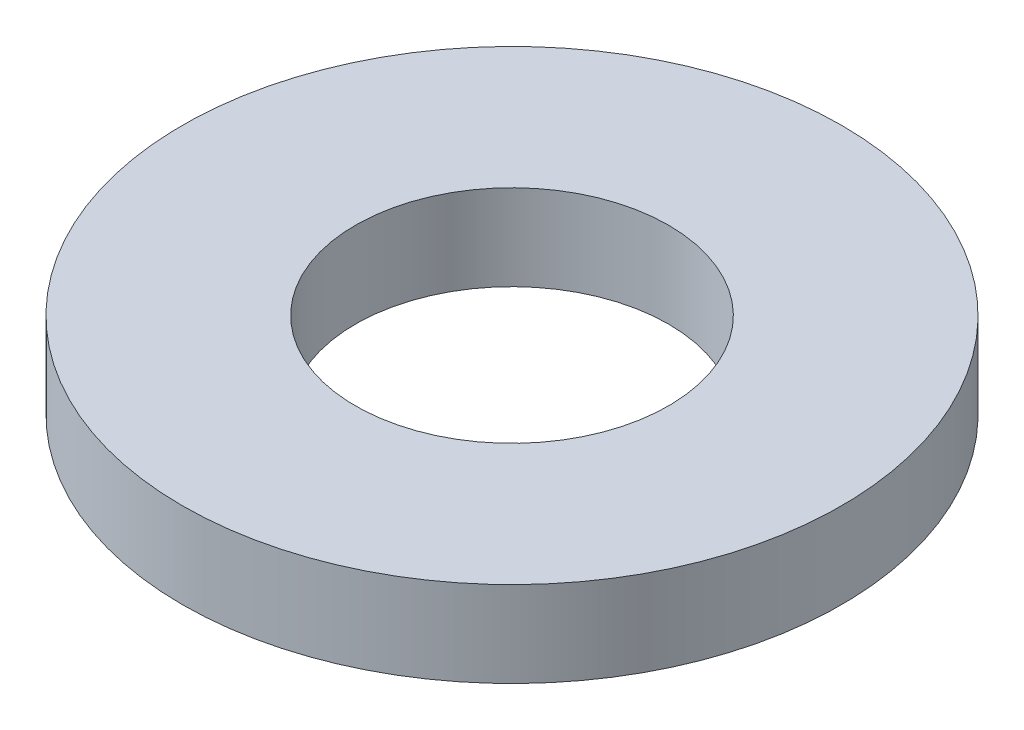
ISO-10303-21;
HEADER;
FILE_DESCRIPTION(('STEP AP214'),'2;1');
FILE_NAME('part.step','',(''),(''),'','','');
FILE_SCHEMA(('AUTOMOTIVE_DESIGN { 1 0 10303 214 1 1 1 1 }'));
ENDSEC;
DATA;
#1=APPLICATION_CONTEXT('core data for automotive mechanical design processes');
#2=APPLICATION_PROTOCOL_DEFINITION('international standard','automotive_design',2000,#1);
#3=PRODUCT_CONTEXT('',#1,'mechanical');
#4=PRODUCT('Part','Part','',(#3));
#5=PRODUCT_RELATED_PRODUCT_CATEGORY('part','',(#4));
#6=PRODUCT_DEFINITION_FORMATION('','',#4);
#7=PRODUCT_DEFINITION_CONTEXT('part definition',#1,'design');
#8=PRODUCT_DEFINITION('design','',#6,#7);
#9=PRODUCT_DEFINITION_SHAPE('','',#8);
#10=(LENGTH_UNIT() NAMED_UNIT(*) SI_UNIT(.MILLI.,.METRE.));
#11=(NAMED_UNIT(*) PLANE_ANGLE_UNIT() SI_UNIT($,.RADIAN.));
#12=(NAMED_UNIT(*) SI_UNIT($,.STERADIAN.) SOLID_ANGLE_UNIT());
#13=UNCERTAINTY_MEASURE_WITH_UNIT(LENGTH_MEASURE(1.E-05),#10,'distance_accuracy_value','');
#14=(GEOMETRIC_REPRESENTATION_CONTEXT(3) GLOBAL_UNCERTAINTY_ASSIGNED_CONTEXT((#13)) GLOBAL_UNIT_ASSIGNED_CONTEXT((#10,
#11,#12)) REPRESENTATION_CONTEXT('',''));
#15=CARTESIAN_POINT('',(0.,0.,0.));
#16=DIRECTION('',(0.,0.,1.));
#17=DIRECTION('',(1.,0.,0.));
#18=AXIS2_PLACEMENT_3D('',#15,#16,#17);
#19=CARTESIAN_POINT('',(0.,26.,0.));
#20=DIRECTION('',(0.,-1.,0.));
#21=DIRECTION('',(0.,0.,-1.));
#22=AXIS2_PLACEMENT_3D('',#19,#20,#21);
#23=CYLINDRICAL_SURFACE('',#22,100.);
#24=CARTESIAN_POINT('',(0.,26.,0.));
#25=DIRECTION('',(0.,1.,0.));
#26=DIRECTION('',(0.,0.,1.));
#27=AXIS2_PLACEMENT_3D('',#24,#25,#26);
#28=CIRCLE('',#27,100.);
#29=CARTESIAN_POINT('',(0.,26.,-100.));
#30=VERTEX_POINT('',#29);
#31=EDGE_CURVE('E10',#30,#30,#28,.T.);
#32=CARTESIAN_POINT('',(0.,0.,0.));
#33=DIRECTION('',(0.,1.,0.));
#34=DIRECTION('',(0.,0.,1.));
#35=AXIS2_PLACEMENT_3D('',#32,#33,#34);
#36=CIRCLE('',#35,100.);
#37=CARTESIAN_POINT('',(0.,0.,-100.));
#38=VERTEX_POINT('',#37);
#39=EDGE_CURVE('E37',#38,#38,#36,.T.);
#40=CARTESIAN_POINT('',(0.,26.,-100.));
#41=CARTESIAN_POINT('',(0.,25.7291666666667,-100.));
#42=CARTESIAN_POINT('',(0.,25.4583333333333,-100.));
#43=CARTESIAN_POINT('',(0.,24.9166666666667,-100.));
#44=CARTESIAN_POINT('',(0.,24.6458333333333,-100.));
#45=CARTESIAN_POINT('',(0.,24.1041666666667,-100.));
#46=CARTESIAN_POINT('',(0.,23.8333333333333,-100.));
#47=CARTESIAN_POINT('',(0.,23.2916666666667,-100.));
#48=CARTESIAN_POINT('',(0.,23.0208333333333,-100.));
#49=CARTESIAN_POINT('',(0.,22.4791666666667,-100.));
#50=CARTESIAN_POINT('',(0.,22.2083333333333,-100.));
#51=CARTESIAN_POINT('',(0.,21.6666666666667,-100.));
#52=CARTESIAN_POINT('',(0.,21.3958333333333,-100.));
#53=CARTESIAN_POINT('',(0.,20.8541666666667,-100.));
#54=CARTESIAN_POINT('',(0.,20.5833333333333,-100.));
#55=CARTESIAN_POINT('',(0.,20.0416666666667,-100.));
#56=CARTESIAN_POINT('',(0.,19.7708333333333,-100.));
#57=CARTESIAN_POINT('',(0.,19.2291666666667,-100.));
#58=CARTESIAN_POINT('',(0.,18.9583333333333,-100.));
#59=CARTESIAN_POINT('',(0.,18.4166666666667,-100.));
#60=CARTESIAN_POINT('',(0.,18.1458333333333,-100.));
#61=CARTESIAN_POINT('',(0.,17.6041666666667,-100.));
#62=CARTESIAN_POINT('',(0.,17.3333333333333,-100.));
#63=CARTESIAN_POINT('',(0.,16.7916666666667,-100.));
#64=CARTESIAN_POINT('',(0.,16.5208333333333,-100.));
#65=CARTESIAN_POINT('',(0.,15.9791666666667,-100.));
#66=CARTESIAN_POINT('',(0.,15.7083333333333,-100.));
#67=CARTESIAN_POINT('',(0.,15.1666666666667,-100.));
#68=CARTESIAN_POINT('',(0.,14.8958333333333,-100.));
#69=CARTESIAN_POINT('',(0.,14.3541666666667,-100.));
#70=CARTESIAN_POINT('',(0.,14.0833333333333,-100.));
#71=CARTESIAN_POINT('',(0.,13.5416666666667,-100.));
#72=CARTESIAN_POINT('',(0.,13.2708333333333,-100.));
#73=CARTESIAN_POINT('',(0.,12.7291666666667,-100.));
#74=CARTESIAN_POINT('',(0.,12.4583333333333,-100.));
#75=CARTESIAN_POINT('',(0.,11.9166666666667,-100.));
#76=CARTESIAN_POINT('',(0.,11.6458333333333,-100.));
#77=CARTESIAN_POINT('',(0.,11.1041666666667,-100.));
#78=CARTESIAN_POINT('',(0.,10.8333333333333,-100.));
#79=CARTESIAN_POINT('',(0.,10.2916666666667,-100.));
#80=CARTESIAN_POINT('',(0.,10.0208333333333,-100.));
#81=CARTESIAN_POINT('',(0.,9.47916666666667,-100.));
#82=CARTESIAN_POINT('',(0.,9.20833333333333,-100.));
#83=CARTESIAN_POINT('',(0.,8.66666666666667,-100.));
#84=CARTESIAN_POINT('',(0.,8.39583333333333,-100.));
#85=CARTESIAN_POINT('',(0.,7.85416666666667,-100.));
#86=CARTESIAN_POINT('',(0.,7.58333333333333,-100.));
#87=CARTESIAN_POINT('',(0.,7.04166666666667,-100.));
#88=CARTESIAN_POINT('',(0.,6.77083333333333,-100.));
#89=CARTESIAN_POINT('',(0.,6.22916666666667,-100.));
#90=CARTESIAN_POINT('',(0.,5.95833333333333,-100.));
#91=CARTESIAN_POINT('',(0.,5.41666666666667,-100.));
#92=CARTESIAN_POINT('',(0.,5.14583333333333,-100.));
#93=CARTESIAN_POINT('',(0.,4.60416666666667,-100.));
#94=CARTESIAN_POINT('',(0.,4.33333333333333,-100.));
#95=CARTESIAN_POINT('',(0.,3.79166666666667,-100.));
#96=CARTESIAN_POINT('',(0.,3.52083333333333,-100.));
#97=CARTESIAN_POINT('',(0.,2.97916666666667,-100.));
#98=CARTESIAN_POINT('',(0.,2.70833333333333,-100.));
#99=CARTESIAN_POINT('',(0.,2.16666666666667,-100.));
#100=CARTESIAN_POINT('',(0.,1.89583333333333,-100.));
#101=CARTESIAN_POINT('',(0.,1.35416666666667,-100.));
#102=CARTESIAN_POINT('',(0.,1.08333333333333,-100.));
#103=CARTESIAN_POINT('',(0.,0.541666666666667,-100.));
#104=CARTESIAN_POINT('',(0.,0.270833333333334,-100.));
#105=CARTESIAN_POINT('',(0.,0.,-100.));
#106=B_SPLINE_CURVE_WITH_KNOTS('',3,(#40,#41,#42,#43,#44,#45,#46,#47,#48,#49,#50,#51,#52,#53,
#54,#55,#56,#57,#58,#59,#60,#61,#62,#63,#64,#65,#66,#67,#68,#69,#70,#71,#72,#73,#74,#75,#76,#77,
#78,#79,#80,#81,#82,#83,#84,#85,#86,#87,#88,#89,#90,#91,#92,#93,#94,#95,#96,#97,#98,#99,#100,
#101,#102,#103,#104,#105),.UNSPECIFIED.,.F.,.F.,(4,2,2,2,2,2,2,2,2,2,2,2,2,2,2,2,2,2,2,2,2,2,2,
2,2,2,2,2,2,2,2,2,4),(0.,0.812500000000001,1.625,2.4375,3.25,4.0625,4.875,5.6875,6.5,7.3125,
8.125,8.9375,9.75,10.5625,11.375,12.1875,13.,13.8125,14.625,15.4375,16.25,17.0625,17.875,
18.6875,19.5,20.3125,21.125,21.9375,22.75,23.5625,24.375,25.1875,26.),.UNSPECIFIED.);
#107=EDGE_CURVE('BSEAM40',#30,#38,#106,.T.);
#108=ORIENTED_EDGE('',*,*,#31,.F.);
#109=ORIENTED_EDGE('',*,*,#39,.T.);
#110=ORIENTED_EDGE('',*,*,#107,.T.);
#111=ORIENTED_EDGE('',*,*,#107,.F.);
#112=EDGE_LOOP('',(#108,#110,#109,#111));
#113=FACE_BOUND('',#112,.T.);
#114=ADVANCED_FACE('F40',(#113),#23,.T.);
#115=CARTESIAN_POINT('',(0.,26.,0.));
#116=DIRECTION('',(0.,1.,0.));
#117=DIRECTION('',(0.,0.,1.));
#118=AXIS2_PLACEMENT_3D('',#115,#116,#117);
#119=PLANE('',#118);
#120=CARTESIAN_POINT('',(0.,26.,0.));
#121=DIRECTION('',(0.,1.,0.));
#122=DIRECTION('',(0.,0.,1.));
#123=AXIS2_PLACEMENT_3D('',#120,#121,#122);
#124=CIRCLE('',#123,47.5);
#125=CARTESIAN_POINT('',(0.,26.,-47.5));
#126=VERTEX_POINT('',#125);
#127=EDGE_CURVE('E50',#126,#126,#124,.T.);
#128=ORIENTED_EDGE('',*,*,#127,.F.);
#129=EDGE_LOOP('',(#128));
#130=FACE_BOUND('',#129,.T.);
#131=ORIENTED_EDGE('',*,*,#31,.T.);
#132=EDGE_LOOP('',(#131));
#133=FACE_BOUND('',#132,.T.);
#134=ADVANCED_FACE('F59',(#130,#133),#119,.T.);
#135=CARTESIAN_POINT('',(0.,0.,0.));
#136=DIRECTION('',(0.,1.,0.));
#137=DIRECTION('',(0.,0.,1.));
#138=AXIS2_PLACEMENT_3D('',#135,#136,#137);
#139=PLANE('',#138);
#140=CARTESIAN_POINT('',(0.,0.,0.));
#141=DIRECTION('',(0.,1.,0.));
#142=DIRECTION('',(0.,0.,1.));
#143=AXIS2_PLACEMENT_3D('',#140,#141,#142);
#144=CIRCLE('',#143,47.5);
#145=CARTESIAN_POINT('',(0.,0.,-47.5));
#146=VERTEX_POINT('',#145);
#147=EDGE_CURVE('E47',#146,#146,#144,.T.);
#148=ORIENTED_EDGE('',*,*,#147,.T.);
#149=EDGE_LOOP('',(#148));
#150=FACE_BOUND('',#149,.T.);
#151=ORIENTED_EDGE('',*,*,#39,.F.);
#152=EDGE_LOOP('',(#151));
#153=FACE_BOUND('',#152,.T.);
#154=ADVANCED_FACE('F58',(#150,#153),#139,.F.);
#155=CARTESIAN_POINT('',(0.,26.,0.));
#156=DIRECTION('',(0.,-1.,0.));
#157=DIRECTION('',(0.,0.,-1.));
#158=AXIS2_PLACEMENT_3D('',#155,#156,#157);
#159=CYLINDRICAL_SURFACE('',#158,47.5);
#160=CARTESIAN_POINT('',(0.,26.,-47.5));
#161=CARTESIAN_POINT('',(0.,25.7291666666667,-47.5));
#162=CARTESIAN_POINT('',(0.,25.4583333333333,-47.5));
#163=CARTESIAN_POINT('',(0.,24.9166666666667,-47.5));
#164=CARTESIAN_POINT('',(0.,24.6458333333333,-47.5));
#165=CARTESIAN_POINT('',(0.,24.1041666666667,-47.5));
#166=CARTESIAN_POINT('',(0.,23.8333333333333,-47.5));
#167=CARTESIAN_POINT('',(0.,23.2916666666667,-47.5));
#168=CARTESIAN_POINT('',(0.,23.0208333333333,-47.5));
#169=CARTESIAN_POINT('',(0.,22.4791666666667,-47.5));
#170=CARTESIAN_POINT('',(0.,22.2083333333333,-47.5));
#171=CARTESIAN_POINT('',(0.,21.6666666666667,-47.5));
#172=CARTESIAN_POINT('',(0.,21.3958333333333,-47.5));
#173=CARTESIAN_POINT('',(0.,20.8541666666667,-47.5));
#174=CARTESIAN_POINT('',(0.,20.5833333333333,-47.5));
#175=CARTESIAN_POINT('',(0.,20.0416666666667,-47.5));
#176=CARTESIAN_POINT('',(0.,19.7708333333333,-47.5));
#177=CARTESIAN_POINT('',(0.,19.2291666666667,-47.5));
#178=CARTESIAN_POINT('',(0.,18.9583333333333,-47.5));
#179=CARTESIAN_POINT('',(0.,18.4166666666667,-47.5));
#180=CARTESIAN_POINT('',(0.,18.1458333333333,-47.5));
#181=CARTESIAN_POINT('',(0.,17.6041666666667,-47.5));
#182=CARTESIAN_POINT('',(0.,17.3333333333333,-47.5));
#183=CARTESIAN_POINT('',(0.,16.7916666666667,-47.5));
#184=CARTESIAN_POINT('',(0.,16.5208333333333,-47.5));
#185=CARTESIAN_POINT('',(0.,15.9791666666667,-47.5));
#186=CARTESIAN_POINT('',(0.,15.7083333333333,-47.5));
#187=CARTESIAN_POINT('',(0.,15.1666666666667,-47.5));
#188=CARTESIAN_POINT('',(0.,14.8958333333333,-47.5));
#189=CARTESIAN_POINT('',(0.,14.3541666666667,-47.5));
#190=CARTESIAN_POINT('',(0.,14.0833333333333,-47.5));
#191=CARTESIAN_POINT('',(0.,13.5416666666667,-47.5));
#192=CARTESIAN_POINT('',(0.,13.2708333333333,-47.5));
#193=CARTESIAN_POINT('',(0.,12.7291666666667,-47.5));
#194=CARTESIAN_POINT('',(0.,12.4583333333333,-47.5));
#195=CARTESIAN_POINT('',(0.,11.9166666666667,-47.5));
#196=CARTESIAN_POINT('',(0.,11.6458333333333,-47.5));
#197=CARTESIAN_POINT('',(0.,11.1041666666667,-47.5));
#198=CARTESIAN_POINT('',(0.,10.8333333333333,-47.5));
#199=CARTESIAN_POINT('',(0.,10.2916666666667,-47.5));
#200=CARTESIAN_POINT('',(0.,10.0208333333333,-47.5));
#201=CARTESIAN_POINT('',(0.,9.47916666666667,-47.5));
#202=CARTESIAN_POINT('',(0.,9.20833333333333,-47.5));
#203=CARTESIAN_POINT('',(0.,8.66666666666667,-47.5));
#204=CARTESIAN_POINT('',(0.,8.39583333333333,-47.5));
#205=CARTESIAN_POINT('',(0.,7.85416666666667,-47.5));
#206=CARTESIAN_POINT('',(0.,7.58333333333333,-47.5));
#207=CARTESIAN_POINT('',(0.,7.04166666666667,-47.5));
#208=CARTESIAN_POINT('',(0.,6.77083333333333,-47.5));
#209=CARTESIAN_POINT('',(0.,6.22916666666667,-47.5));
#210=CARTESIAN_POINT('',(0.,5.95833333333333,-47.5));
#211=CARTESIAN_POINT('',(0.,5.41666666666667,-47.5));
#212=CARTESIAN_POINT('',(0.,5.14583333333333,-47.5));
#213=CARTESIAN_POINT('',(0.,4.60416666666667,-47.5));
#214=CARTESIAN_POINT('',(0.,4.33333333333333,-47.5));
#215=CARTESIAN_POINT('',(0.,3.79166666666667,-47.5));
#216=CARTESIAN_POINT('',(0.,3.52083333333333,-47.5));
#217=CARTESIAN_POINT('',(0.,2.97916666666667,-47.5));
#218=CARTESIAN_POINT('',(0.,2.70833333333333,-47.5));
#219=CARTESIAN_POINT('',(0.,2.16666666666667,-47.5));
#220=CARTESIAN_POINT('',(0.,1.89583333333333,-47.5));
#221=CARTESIAN_POINT('',(0.,1.35416666666667,-47.5));
#222=CARTESIAN_POINT('',(0.,1.08333333333333,-47.5));
#223=CARTESIAN_POINT('',(0.,0.541666666666667,-47.5));
#224=CARTESIAN_POINT('',(0.,0.270833333333334,-47.5));
#225=CARTESIAN_POINT('',(0.,0.,-47.5));
#226=B_SPLINE_CURVE_WITH_KNOTS('',3,(#160,#161,#162,#163,#164,#165,#166,#167,#168,#169,#170,
#171,#172,#173,#174,#175,#176,#177,#178,#179,#180,#181,#182,#183,#184,#185,#186,#187,#188,#189,
#190,#191,#192,#193,#194,#195,#196,#197,#198,#199,#200,#201,#202,#203,#204,#205,#206,#207,#208,
#209,#210,#211,#212,#213,#214,#215,#216,#217,#218,#219,#220,#221,#222,#223,#224,#225),
.UNSPECIFIED.,.F.,.F.,(4,2,2,2,2,2,2,2,2,2,2,2,2,2,2,2,2,2,2,2,2,2,2,2,2,2,2,2,2,2,2,2,4),(0.,
0.812500000000001,1.625,2.4375,3.25,4.0625,4.875,5.6875,6.5,7.3125,8.125,8.9375,9.75,10.5625,
11.375,12.1875,13.,13.8125,14.625,15.4375,16.25,17.0625,17.875,18.6875,19.5,20.3125,21.125,
21.9375,22.75,23.5625,24.375,25.1875,26.),.UNSPECIFIED.);
#227=EDGE_CURVE('BSEAM54',#126,#146,#226,.T.);
#228=ORIENTED_EDGE('',*,*,#127,.T.);
#229=ORIENTED_EDGE('',*,*,#147,.F.);
#230=ORIENTED_EDGE('',*,*,#227,.T.);
#231=ORIENTED_EDGE('',*,*,#227,.F.);
#232=EDGE_LOOP('',(#228,#230,#229,#231));
#233=FACE_BOUND('',#232,.T.);
#234=ADVANCED_FACE('F54',(#233),#159,.F.);
#235=CLOSED_SHELL('',(#114,#134,#154,#234));
#236=MANIFOLD_SOLID_BREP('B2',#235);
#237=ADVANCED_BREP_SHAPE_REPRESENTATION('',(#18,#236),#14);
#238=SHAPE_DEFINITION_REPRESENTATION(#9,#237);
ENDSEC;
END-ISO-10303-21;
